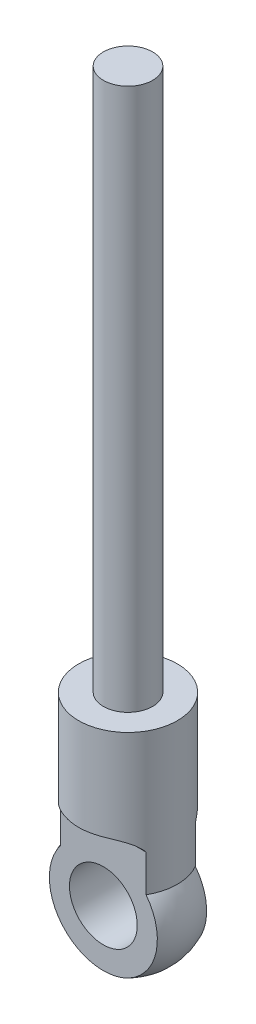
ISO-10303-21;
HEADER;
FILE_DESCRIPTION(('STEP AP214'),'2;1');
FILE_NAME('part.step','',(''),(''),'','','');
FILE_SCHEMA(('AUTOMOTIVE_DESIGN { 1 0 10303 214 1 1 1 1 }'));
ENDSEC;
DATA;
#1=APPLICATION_CONTEXT('core data for automotive mechanical design processes');
#2=APPLICATION_PROTOCOL_DEFINITION('international standard','automotive_design',2000,#1);
#3=PRODUCT_CONTEXT('',#1,'mechanical');
#4=PRODUCT('Part','Part','',(#3));
#5=PRODUCT_RELATED_PRODUCT_CATEGORY('part','',(#4));
#6=PRODUCT_DEFINITION_FORMATION('','',#4);
#7=PRODUCT_DEFINITION_CONTEXT('part definition',#1,'design');
#8=PRODUCT_DEFINITION('design','',#6,#7);
#9=PRODUCT_DEFINITION_SHAPE('','',#8);
#10=(LENGTH_UNIT() NAMED_UNIT(*) SI_UNIT(.MILLI.,.METRE.));
#11=(NAMED_UNIT(*) PLANE_ANGLE_UNIT() SI_UNIT($,.RADIAN.));
#12=(NAMED_UNIT(*) SI_UNIT($,.STERADIAN.) SOLID_ANGLE_UNIT());
#13=UNCERTAINTY_MEASURE_WITH_UNIT(LENGTH_MEASURE(1.E-05),#10,'distance_accuracy_value','');
#14=(GEOMETRIC_REPRESENTATION_CONTEXT(3) GLOBAL_UNCERTAINTY_ASSIGNED_CONTEXT((#13)) GLOBAL_UNIT_ASSIGNED_CONTEXT((#10,
#11,#12)) REPRESENTATION_CONTEXT('',''));
#15=CARTESIAN_POINT('',(0.,0.,0.));
#16=DIRECTION('',(0.,0.,1.));
#17=DIRECTION('',(1.,0.,0.));
#18=AXIS2_PLACEMENT_3D('',#15,#16,#17);
#19=CARTESIAN_POINT('',(0.,-14.1833333333333,0.));
#20=DIRECTION('',(0.,-1.,0.));
#21=DIRECTION('',(-1.,0.,0.));
#22=AXIS2_PLACEMENT_3D('',#19,#20,#21);
#23=SPHERICAL_SURFACE('',#22,4.81666666666666);
#24=CARTESIAN_POINT('',(0.,-14.1833333333333,2.));
#25=DIRECTION('',(0.,0.,-1.));
#26=DIRECTION('',(0.,1.,0.));
#27=AXIS2_PLACEMENT_3D('',#24,#25,#26);
#28=CIRCLE('',#27,4.38181215683395);
#29=CARTESIAN_POINT('',(3.46410161513775,-11.5,2.));
#30=VERTEX_POINT('',#29);
#31=CARTESIAN_POINT('',(-3.46410161513775,-11.5,2.));
#32=VERTEX_POINT('',#31);
#33=EDGE_CURVE('E167',#30,#32,#28,.T.);
#34=ORIENTED_EDGE('',*,*,#33,.T.);
#35=CARTESIAN_POINT('',(0.,-11.5,0.));
#36=DIRECTION('',(0.,-1.,0.));
#37=DIRECTION('',(0.,0.,-1.));
#38=AXIS2_PLACEMENT_3D('',#35,#36,#37);
#39=CIRCLE('',#38,4.);
#40=CARTESIAN_POINT('',(-3.46410161513775,-11.5,-2.));
#41=VERTEX_POINT('',#40);
#42=EDGE_CURVE('E170',#32,#41,#39,.T.);
#43=ORIENTED_EDGE('',*,*,#42,.T.);
#44=CARTESIAN_POINT('',(0.,-14.1833333333333,-2.));
#45=DIRECTION('',(0.,0.,-1.));
#46=DIRECTION('',(0.,1.,0.));
#47=AXIS2_PLACEMENT_3D('',#44,#45,#46);
#48=CIRCLE('',#47,4.38181215683394);
#49=CARTESIAN_POINT('',(3.46410161513775,-11.5,-2.));
#50=VERTEX_POINT('',#49);
#51=EDGE_CURVE('E74',#50,#41,#48,.T.);
#52=ORIENTED_EDGE('',*,*,#51,.F.);
#53=EDGE_CURVE('E111',#50,#30,#39,.T.);
#54=ORIENTED_EDGE('',*,*,#53,.T.);
#55=EDGE_LOOP('',(#34,#43,#52,#54));
#56=FACE_BOUND('',#55,.T.);
#57=ADVANCED_FACE('F51',(#56),#23,.T.);
#58=CARTESIAN_POINT('',(0.,0.,0.));
#59=DIRECTION('',(0.,-1.,0.));
#60=DIRECTION('',(0.,0.,-1.));
#61=AXIS2_PLACEMENT_3D('',#58,#59,#60);
#62=CYLINDRICAL_SURFACE('',#61,4.);
#63=CARTESIAN_POINT('',(0.,0.,0.));
#64=DIRECTION('',(0.,-1.,0.));
#65=DIRECTION('',(0.,0.,-1.));
#66=AXIS2_PLACEMENT_3D('',#63,#64,#65);
#67=CIRCLE('',#66,4.);
#68=CARTESIAN_POINT('',(0.,0.,-4.));
#69=VERTEX_POINT('',#68);
#70=EDGE_CURVE('E178',#69,#69,#67,.T.);
#71=ORIENTED_EDGE('',*,*,#70,.T.);
#72=EDGE_LOOP('',(#71));
#73=FACE_BOUND('',#72,.T.);
#74=CARTESIAN_POINT('',(-3.46410161513776,-11.5,2.));
#75=CARTESIAN_POINT('',(-3.48505742822508,-11.4516236882403,1.96369983455173));
#76=CARTESIAN_POINT('',(-3.50441881772126,-11.4014765354883,1.92885064757099));
#77=CARTESIAN_POINT('',(-3.54013083235496,-11.2980139730111,1.86249743017676));
#78=CARTESIAN_POINT('',(-3.55648210578561,-11.24469924877,1.83099268008719));
#79=CARTESIAN_POINT('',(-3.58633448416375,-11.135350375821,1.77180778083842));
#80=CARTESIAN_POINT('',(-3.59984056854879,-11.0793211928056,1.74412097963159));
#81=CARTESIAN_POINT('',(-3.62423191112977,-10.9648842390785,1.69285106159996));
#82=CARTESIAN_POINT('',(-3.63511712092051,-10.9064764244588,1.66926802057014));
#83=CARTESIAN_POINT('',(-3.66412623193404,-10.7283159282252,1.60512261604379));
#84=CARTESIAN_POINT('',(-3.67863206301334,-10.6055176660132,1.57110487936452));
#85=CARTESIAN_POINT('',(-3.69916546076441,-10.3555539891076,1.52213027146439));
#86=CARTESIAN_POINT('',(-3.70519167881027,-10.2283878830316,1.50717643226485));
#87=CARTESIAN_POINT('',(-3.70938882671181,-9.97149489366128,1.4968202471759));
#88=CARTESIAN_POINT('',(-3.7074591114322,-9.84175599169627,1.50166839566793));
#89=CARTESIAN_POINT('',(-3.69531469409487,-9.58494916267766,1.53130704014173));
#90=CARTESIAN_POINT('',(-3.6850986187928,-9.45788168192239,1.55610084158078));
#91=CARTESIAN_POINT('',(-3.65534567908771,-9.20948906496329,1.62476027814744));
#92=CARTESIAN_POINT('',(-3.63576592394964,-9.08819320561599,1.66871359140429));
#93=CARTESIAN_POINT('',(-3.58574617226035,-8.85564224980118,1.77363488888057));
#94=CARTESIAN_POINT('',(-3.55531023313985,-8.74438342149452,1.83459651449832));
#95=CARTESIAN_POINT('',(-3.4827089343538,-8.53733792578547,1.96886111269921));
#96=CARTESIAN_POINT('',(-3.44080057569296,-8.44127768824531,2.04188116966314));
#97=CARTESIAN_POINT('',(-3.34391896652423,-8.26425537994537,2.19693714971771));
#98=CARTESIAN_POINT('',(-3.28894821897836,-8.18329042198699,2.27897134393901));
#99=CARTESIAN_POINT('',(-3.16632115091152,-8.0382098196445,2.44643855016957));
#100=CARTESIAN_POINT('',(-3.09879023214102,-7.97394149450098,2.53183189592829));
#101=CARTESIAN_POINT('',(-2.95144285753561,-7.86082098328695,2.70216080214703));
#102=CARTESIAN_POINT('',(-2.87162310555112,-7.81197294404888,2.78709623343883));
#103=CARTESIAN_POINT('',(-2.69394312081619,-7.7245411426854,2.95960470212821));
#104=CARTESIAN_POINT('',(-2.59513069086336,-7.68716427149863,3.04679998150616));
#105=CARTESIAN_POINT('',(-2.38677154824466,-7.62556915710695,3.21264489259502));
#106=CARTESIAN_POINT('',(-2.27721493269961,-7.60136319059798,3.29128649693268));
#107=CARTESIAN_POINT('',(-2.07816266343584,-7.56772089288594,3.41928891400126));
#108=CARTESIAN_POINT('',(-1.99053951122883,-7.55610196248371,3.47104306220469));
#109=CARTESIAN_POINT('',(-1.81120713696376,-7.53713026494153,3.56790021216443));
#110=CARTESIAN_POINT('',(-1.71949635468132,-7.52977914207691,3.6130006454325));
#111=CARTESIAN_POINT('',(-1.53261960366885,-7.51817757074083,3.69615401308953));
#112=CARTESIAN_POINT('',(-1.43744940917219,-7.51393105804441,3.73419795641385));
#113=CARTESIAN_POINT('',(-1.24442093301576,-7.50754457612174,3.80288181414419));
#114=CARTESIAN_POINT('',(-1.14656290718302,-7.50540440712357,3.83352243049585));
#115=CARTESIAN_POINT('',(-0.947470687492997,-7.50238146239822,3.88755425095047));
#116=CARTESIAN_POINT('',(-0.846209055864686,-7.50151553127478,3.91084519593677));
#117=CARTESIAN_POINT('',(-0.64217764356532,-7.50043576725357,3.94947954499916));
#118=CARTESIAN_POINT('',(-0.539407843874386,-7.50022194258678,3.96482284875685));
#119=CARTESIAN_POINT('',(-0.333023763641647,-7.5000057179673,3.98746380930005));
#120=CARTESIAN_POINT('',(-0.229409810295539,-7.5000032396633,3.99476444670941));
#121=CARTESIAN_POINT('',(-0.0219267732101429,-7.4999983198757,4.00128644869187));
#122=CARTESIAN_POINT('',(0.0819423180896407,-7.49999587839321,4.00050757088553));
#123=CARTESIAN_POINT('',(0.29777691989608,-7.50001219007271,3.99048015565368));
#124=CARTESIAN_POINT('',(0.409711172077717,-7.50003268972412,3.98054539057031));
#125=CARTESIAN_POINT('',(0.632357887244195,-7.50043190502387,3.9512950059505));
#126=CARTESIAN_POINT('',(0.743070211956088,-7.50081066080032,3.93197833566896));
#127=CARTESIAN_POINT('',(0.962520204687622,-7.50257348287296,3.88409237366952));
#128=CARTESIAN_POINT('',(1.07125697425405,-7.5039579953943,3.85551897812918));
#129=CARTESIAN_POINT('',(1.28589412816036,-7.50867060713599,3.78933803047751));
#130=CARTESIAN_POINT('',(1.39179500420719,-7.51199836711052,3.75173205591885));
#131=CARTESIAN_POINT('',(1.5831570578028,-7.52101862140842,3.67457159963226));
#132=CARTESIAN_POINT('',(1.66916223985222,-7.52624369973875,3.6363073915507));
#133=CARTESIAN_POINT('',(1.83806542085,-7.5397653655292,3.55391890095554));
#134=CARTESIAN_POINT('',(1.92096394222509,-7.54806143398549,3.50979560944699));
#135=CARTESIAN_POINT('',(2.08297268266984,-7.568663912715,3.41613331905007));
#136=CARTESIAN_POINT('',(2.16208822830934,-7.58096448165086,3.36660227793519));
#137=CARTESIAN_POINT('',(2.31602285264499,-7.61061014043094,3.26261495721181));
#138=CARTESIAN_POINT('',(2.39084303844722,-7.62795392336031,3.2081599561302));
#139=CARTESIAN_POINT('',(2.51930646044854,-7.66417414726008,3.10776053039405));
#140=CARTESIAN_POINT('',(2.57393945087159,-7.68183725366142,3.06264169085348));
#141=CARTESIAN_POINT('',(2.67988593564515,-7.72131753156808,2.97037735516947));
#142=CARTESIAN_POINT('',(2.73120020849824,-7.74313372407532,2.92323233867615));
#143=CARTESIAN_POINT('',(2.83019101144801,-7.79135431775187,2.82750045801087));
#144=CARTESIAN_POINT('',(2.8778682426104,-7.81775783145003,2.77891387423191));
#145=CARTESIAN_POINT('',(2.96928366611156,-7.87549924530486,2.68101419839438));
#146=CARTESIAN_POINT('',(3.01302383150834,-7.90683465195998,2.63170148481648));
#147=CARTESIAN_POINT('',(3.09669701306069,-7.97497049462831,2.53272602248669));
#148=CARTESIAN_POINT('',(3.13659605473353,-8.01181343406049,2.48306370052988));
#149=CARTESIAN_POINT('',(3.2120022640101,-8.09085299285066,2.38471807238895));
#150=CARTESIAN_POINT('',(3.24751147949259,-8.1330470971067,2.33603431864129));
#151=CARTESIAN_POINT('',(3.31410727401972,-8.22274496647899,2.24055385745405));
#152=CARTESIAN_POINT('',(3.34519379041616,-8.27024880679143,2.19375717675185));
#153=CARTESIAN_POINT('',(3.40299180099458,-8.37030485858221,2.10298475464623));
#154=CARTESIAN_POINT('',(3.42970377441903,-8.42285651605705,2.05900870455697));
#155=CARTESIAN_POINT('',(3.49748039066586,-8.57412251046848,1.94292461255456));
#156=CARTESIAN_POINT('',(3.53419505154906,-8.67778527746387,1.87458509494025));
#157=CARTESIAN_POINT('',(3.59601020259842,-8.89673508930151,1.75311018664678));
#158=CARTESIAN_POINT('',(3.6211106842399,-9.01202214267577,1.69997480712728));
#159=CARTESIAN_POINT('',(3.66092996906082,-9.24836326617673,1.61240873426991));
#160=CARTESIAN_POINT('',(3.67585393627529,-9.36924740885467,1.57761182251698));
#161=CARTESIAN_POINT('',(3.69736051740217,-9.61557185362247,1.52653196321747));
#162=CARTESIAN_POINT('',(3.70394286967647,-9.74101229849565,1.51024959638873));
#163=CARTESIAN_POINT('',(3.70945509492467,-9.99611909135715,1.49666425836184));
#164=CARTESIAN_POINT('',(3.70819704883148,-10.1258145014297,1.49982733221703));
#165=CARTESIAN_POINT('',(3.69745356488751,-10.3828799481525,1.52611698300973));
#166=CARTESIAN_POINT('',(3.68796489432344,-10.5102490510347,1.54925140400566));
#167=CARTESIAN_POINT('',(3.659771953275,-10.7597516698588,1.61472761576265));
#168=CARTESIAN_POINT('',(3.64100965483043,-10.8818468857131,1.6571902148699));
#169=CARTESIAN_POINT('',(3.592741099643,-11.1161608643074,1.75936509106798));
#170=CARTESIAN_POINT('',(3.56325570666003,-11.2283982842667,1.8190438246826));
#171=CARTESIAN_POINT('',(3.51798148232311,-11.3626654131736,1.90373973145959));
#172=CARTESIAN_POINT('',(3.50785467605053,-11.3908664315831,1.92235042726624));
#173=CARTESIAN_POINT('',(3.48667938494603,-11.4462171408237,1.96049560162438));
#174=CARTESIAN_POINT('',(3.47563219526777,-11.4733682328313,1.98002876585539));
#175=CARTESIAN_POINT('',(3.46410161513776,-11.5,2.));
#176=B_SPLINE_CURVE_WITH_KNOTS('',3,(#74,#75,#76,#77,#78,#79,#80,#81,#82,#83,#84,#85,#86,#87,
#88,#89,#90,#91,#92,#93,#94,#95,#96,#97,#98,#99,#100,#101,#102,#103,#104,#105,#106,#107,#108,
#109,#110,#111,#112,#113,#114,#115,#116,#117,#118,#119,#120,#121,#122,#123,#124,#125,#126,#127,
#128,#129,#130,#131,#132,#133,#134,#135,#136,#137,#138,#139,#140,#141,#142,#143,#144,#145,#146,
#147,#148,#149,#150,#151,#152,#153,#154,#155,#156,#157,#158,#159,#160,#161,#162,#163,#164,#165,
#166,#167,#168,#169,#170,#171,#172,#173,#174,#175),.UNSPECIFIED.,.F.,.F.,(4,2,2,2,2,2,2,2,2,2,2,
2,2,2,2,2,2,2,2,2,2,2,2,2,2,2,2,2,2,2,2,2,2,2,2,2,2,2,2,2,2,2,2,2,2,2,2,2,2,2,4),(0.,
0.191956150665621,0.383870910960549,0.575446953519253,0.767026534043728,1.14981009539002,
1.53265452903099,1.92035683255558,2.30812340058271,2.69768341477958,3.08709798565704,
3.46841689115728,3.84966278871073,4.22728885793394,4.60501639224434,5.01447344631598,
5.42431150731335,5.73121424297416,6.03823514194969,6.34564458560031,6.65302487081047,
6.96443311960283,7.27584529902211,7.58714202976914,7.89844809921356,8.2351675519216,
8.57192472489245,8.90883139859596,9.24567927380462,9.52825201467944,9.81077702195,
10.0928917447584,10.3749334244967,10.5938045136342,10.8126240725046,11.031401345205,
11.2500683601638,11.470519489006,11.6908673849298,11.9112184018038,12.1315452624832,
12.5178770836597,12.9042091883986,13.2825020852019,13.6608068470212,14.0482131466708,
14.4357716754576,14.8257865779018,15.2150466590723,15.3208410617573,15.4264890279366),.UNSPECIFIED.);
#177=CARTESIAN_POINT('',(-3.46410161513776,-8.5,2.));
#178=VERTEX_POINT('',#177);
#179=CARTESIAN_POINT('',(3.46410161513776,-8.5,2.));
#180=VERTEX_POINT('',#179);
#181=EDGE_CURVE('E113',#178,#180,#176,.T.);
#182=ORIENTED_EDGE('',*,*,#181,.T.);
#183=DIRECTION('',(0.,-1.,0.));
#184=VECTOR('',#183,1.);
#185=CARTESIAN_POINT('',(3.46410161513775,0.,2.));
#186=LINE('',#185,#184);
#187=EDGE_CURVE('E11',#180,#30,#186,.T.);
#188=ORIENTED_EDGE('',*,*,#187,.T.);
#189=ORIENTED_EDGE('',*,*,#53,.F.);
#190=DIRECTION('',(0.,-1.,0.));
#191=VECTOR('',#190,1.);
#192=CARTESIAN_POINT('',(3.46410161513775,0.,-2.));
#193=LINE('',#192,#191);
#194=CARTESIAN_POINT('',(3.46410161513775,-8.49999999999999,-2.));
#195=VERTEX_POINT('',#194);
#196=EDGE_CURVE('E100',#195,#50,#193,.T.);
#197=ORIENTED_EDGE('',*,*,#196,.F.);
#198=CARTESIAN_POINT('',(-3.46410161513775,-11.5,-2.));
#199=CARTESIAN_POINT('',(-3.48505742822508,-11.4516236882403,-1.96369983455173));
#200=CARTESIAN_POINT('',(-3.50441881772126,-11.4014765354883,-1.92885064757099));
#201=CARTESIAN_POINT('',(-3.54013083235496,-11.2980139730111,-1.86249743017676));
#202=CARTESIAN_POINT('',(-3.55648210578561,-11.24469924877,-1.83099268008719));
#203=CARTESIAN_POINT('',(-3.58633448416375,-11.135350375821,-1.77180778083843));
#204=CARTESIAN_POINT('',(-3.59984056854879,-11.0793211928056,-1.74412097963159));
#205=CARTESIAN_POINT('',(-3.62423191112977,-10.9648842390785,-1.69285106159996));
#206=CARTESIAN_POINT('',(-3.63511712092051,-10.9064764244588,-1.66926802057014));
#207=CARTESIAN_POINT('',(-3.66412623193404,-10.7283159282252,-1.60512261604379));
#208=CARTESIAN_POINT('',(-3.67863206301334,-10.6055176660132,-1.57110487936452));
#209=CARTESIAN_POINT('',(-3.69916546076441,-10.3555539891076,-1.52213027146439));
#210=CARTESIAN_POINT('',(-3.70519167881027,-10.2283878830316,-1.50717643226485));
#211=CARTESIAN_POINT('',(-3.70938882671181,-9.97149489366128,-1.4968202471759));
#212=CARTESIAN_POINT('',(-3.7074591114322,-9.84175599169627,-1.50166839566793));
#213=CARTESIAN_POINT('',(-3.69531469409487,-9.58494916267766,-1.53130704014173));
#214=CARTESIAN_POINT('',(-3.6850986187928,-9.45788168192239,-1.55610084158078));
#215=CARTESIAN_POINT('',(-3.65534567908771,-9.20948906496329,-1.62476027814744));
#216=CARTESIAN_POINT('',(-3.63576592394964,-9.08819320561599,-1.66871359140429));
#217=CARTESIAN_POINT('',(-3.58574617226035,-8.85564224980118,-1.77363488888057));
#218=CARTESIAN_POINT('',(-3.55531023313985,-8.74438342149452,-1.83459651449832));
#219=CARTESIAN_POINT('',(-3.4827089343538,-8.53733792578547,-1.96886111269921));
#220=CARTESIAN_POINT('',(-3.44080057569296,-8.44127768824531,-2.04188116966314));
#221=CARTESIAN_POINT('',(-3.34391896652423,-8.26425537994537,-2.19693714971771));
#222=CARTESIAN_POINT('',(-3.28894821897836,-8.18329042198699,-2.27897134393901));
#223=CARTESIAN_POINT('',(-3.16632115091152,-8.0382098196445,-2.44643855016957));
#224=CARTESIAN_POINT('',(-3.09879023214102,-7.97394149450098,-2.53183189592829));
#225=CARTESIAN_POINT('',(-2.95144285753561,-7.86082098328695,-2.70216080214703));
#226=CARTESIAN_POINT('',(-2.87162310555112,-7.81197294404888,-2.78709623343883));
#227=CARTESIAN_POINT('',(-2.69394312081619,-7.72454114268539,-2.95960470212821));
#228=CARTESIAN_POINT('',(-2.59513069086336,-7.68716427149862,-3.04679998150616));
#229=CARTESIAN_POINT('',(-2.38677154824466,-7.62556915710695,-3.21264489259502));
#230=CARTESIAN_POINT('',(-2.27721493269961,-7.60136319059797,-3.29128649693268));
#231=CARTESIAN_POINT('',(-2.07816266343583,-7.56772089288594,-3.41928891400126));
#232=CARTESIAN_POINT('',(-1.99053951122883,-7.55610196248371,-3.47104306220469));
#233=CARTESIAN_POINT('',(-1.81120713696376,-7.53713026494153,-3.56790021216443));
#234=CARTESIAN_POINT('',(-1.71949635468132,-7.5297791420769,-3.6130006454325));
#235=CARTESIAN_POINT('',(-1.53261960366885,-7.51817757074083,-3.69615401308952));
#236=CARTESIAN_POINT('',(-1.43744940917219,-7.5139310580444,-3.73419795641385));
#237=CARTESIAN_POINT('',(-1.24442093301576,-7.50754457612174,-3.80288181414419));
#238=CARTESIAN_POINT('',(-1.14656290718302,-7.50540440712357,-3.83352243049585));
#239=CARTESIAN_POINT('',(-0.947470687492997,-7.50238146239822,-3.88755425095047));
#240=CARTESIAN_POINT('',(-0.846209055864686,-7.50151553127478,-3.91084519593677));
#241=CARTESIAN_POINT('',(-0.64217764356532,-7.50043576725357,-3.94947954499916));
#242=CARTESIAN_POINT('',(-0.539407843874386,-7.50022194258678,-3.96482284875685));
#243=CARTESIAN_POINT('',(-0.333023763641646,-7.50000571796729,-3.98746380930005));
#244=CARTESIAN_POINT('',(-0.229409810295539,-7.5000032396633,-3.99476444670941));
#245=CARTESIAN_POINT('',(-0.0219267732101429,-7.4999983198757,-4.00128644869187));
#246=CARTESIAN_POINT('',(0.0819423180896408,-7.49999587839321,-4.00050757088553));
#247=CARTESIAN_POINT('',(0.29777691989608,-7.5000121900727,-3.99048015565368));
#248=CARTESIAN_POINT('',(0.409711172077717,-7.50003268972412,-3.98054539057031));
#249=CARTESIAN_POINT('',(0.632357887244195,-7.50043190502386,-3.9512950059505));
#250=CARTESIAN_POINT('',(0.743070211956088,-7.50081066080031,-3.93197833566896));
#251=CARTESIAN_POINT('',(0.962520204687623,-7.50257348287295,-3.88409237366952));
#252=CARTESIAN_POINT('',(1.07125697425405,-7.5039579953943,-3.85551897812918));
#253=CARTESIAN_POINT('',(1.28589412816036,-7.50867060713599,-3.78933803047751));
#254=CARTESIAN_POINT('',(1.39179500420719,-7.51199836711052,-3.75173205591885));
#255=CARTESIAN_POINT('',(1.5831570578028,-7.52101862140842,-3.67457159963226));
#256=CARTESIAN_POINT('',(1.66916223985222,-7.52624369973875,-3.6363073915507));
#257=CARTESIAN_POINT('',(1.83806542085,-7.5397653655292,-3.55391890095554));
#258=CARTESIAN_POINT('',(1.92096394222509,-7.54806143398549,-3.50979560944699));
#259=CARTESIAN_POINT('',(2.08297268266984,-7.568663912715,-3.41613331905007));
#260=CARTESIAN_POINT('',(2.16208822830934,-7.58096448165086,-3.3666022779352));
#261=CARTESIAN_POINT('',(2.316022852645,-7.61061014043094,-3.26261495721181));
#262=CARTESIAN_POINT('',(2.39084303844722,-7.6279539233603,-3.2081599561302));
#263=CARTESIAN_POINT('',(2.51930646044854,-7.66417414726007,-3.10776053039405));
#264=CARTESIAN_POINT('',(2.57393945087159,-7.68183725366142,-3.06264169085348));
#265=CARTESIAN_POINT('',(2.67988593564515,-7.72131753156808,-2.97037735516947));
#266=CARTESIAN_POINT('',(2.73120020849824,-7.74313372407532,-2.92323233867615));
#267=CARTESIAN_POINT('',(2.83019101144801,-7.79135431775187,-2.82750045801087));
#268=CARTESIAN_POINT('',(2.8778682426104,-7.81775783145003,-2.77891387423191));
#269=CARTESIAN_POINT('',(2.96928366611156,-7.87549924530486,-2.68101419839438));
#270=CARTESIAN_POINT('',(3.01302383150834,-7.90683465195998,-2.63170148481648));
#271=CARTESIAN_POINT('',(3.09669701306069,-7.97497049462831,-2.53272602248669));
#272=CARTESIAN_POINT('',(3.13659605473353,-8.01181343406049,-2.48306370052988));
#273=CARTESIAN_POINT('',(3.2120022640101,-8.09085299285066,-2.38471807238895));
#274=CARTESIAN_POINT('',(3.24751147949259,-8.1330470971067,-2.33603431864129));
#275=CARTESIAN_POINT('',(3.31410727401972,-8.22274496647899,-2.24055385745405));
#276=CARTESIAN_POINT('',(3.34519379041616,-8.27024880679143,-2.19375717675185));
#277=CARTESIAN_POINT('',(3.40299180099458,-8.37030485858221,-2.10298475464623));
#278=CARTESIAN_POINT('',(3.42970377441903,-8.42285651605705,-2.05900870455697));
#279=CARTESIAN_POINT('',(3.49748039066586,-8.57412251046848,-1.94292461255456));
#280=CARTESIAN_POINT('',(3.53419505154906,-8.67778527746387,-1.87458509494025));
#281=CARTESIAN_POINT('',(3.59601020259842,-8.89673508930151,-1.75311018664678));
#282=CARTESIAN_POINT('',(3.6211106842399,-9.01202214267576,-1.69997480712728));
#283=CARTESIAN_POINT('',(3.66092996906082,-9.24836326617673,-1.61240873426991));
#284=CARTESIAN_POINT('',(3.67585393627528,-9.36924740885467,-1.57761182251698));
#285=CARTESIAN_POINT('',(3.69736051740217,-9.61557185362247,-1.52653196321747));
#286=CARTESIAN_POINT('',(3.70394286967647,-9.74101229849565,-1.51024959638873));
#287=CARTESIAN_POINT('',(3.70945509492467,-9.99611909135715,-1.49666425836184));
#288=CARTESIAN_POINT('',(3.70819704883148,-10.1258145014297,-1.49982733221703));
#289=CARTESIAN_POINT('',(3.69745356488751,-10.3828799481525,-1.52611698300973));
#290=CARTESIAN_POINT('',(3.68796489432344,-10.5102490510347,-1.54925140400566));
#291=CARTESIAN_POINT('',(3.65977195327499,-10.7597516698588,-1.61472761576266));
#292=CARTESIAN_POINT('',(3.64100965483043,-10.8818468857131,-1.6571902148699));
#293=CARTESIAN_POINT('',(3.592741099643,-11.1161608643074,-1.75936509106798));
#294=CARTESIAN_POINT('',(3.56325570666003,-11.2283982842667,-1.8190438246826));
#295=CARTESIAN_POINT('',(3.51798148232311,-11.3626654131736,-1.9037397314596));
#296=CARTESIAN_POINT('',(3.50785467605053,-11.3908664315831,-1.92235042726624));
#297=CARTESIAN_POINT('',(3.48667938494603,-11.4462171408237,-1.96049560162438));
#298=CARTESIAN_POINT('',(3.47563219526776,-11.4733682328313,-1.98002876585539));
#299=CARTESIAN_POINT('',(3.46410161513775,-11.5,-2.));
#300=B_SPLINE_CURVE_WITH_KNOTS('',3,(#198,#199,#200,#201,#202,#203,#204,#205,#206,#207,#208,
#209,#210,#211,#212,#213,#214,#215,#216,#217,#218,#219,#220,#221,#222,#223,#224,#225,#226,#227,
#228,#229,#230,#231,#232,#233,#234,#235,#236,#237,#238,#239,#240,#241,#242,#243,#244,#245,#246,
#247,#248,#249,#250,#251,#252,#253,#254,#255,#256,#257,#258,#259,#260,#261,#262,#263,#264,#265,
#266,#267,#268,#269,#270,#271,#272,#273,#274,#275,#276,#277,#278,#279,#280,#281,#282,#283,#284,
#285,#286,#287,#288,#289,#290,#291,#292,#293,#294,#295,#296,#297,#298,#299),.UNSPECIFIED.,.F.,
.F.,(4,2,2,2,2,2,2,2,2,2,2,2,2,2,2,2,2,2,2,2,2,2,2,2,2,2,2,2,2,2,2,2,2,2,2,2,2,2,2,2,2,2,2,2,2,
2,2,2,2,2,4),(0.,0.191956150665621,0.383870910960549,0.575446953519252,0.767026534043728,
1.14981009539002,1.53265452903099,1.92035683255558,2.30812340058271,2.69768341477958,
3.08709798565704,3.46841689115728,3.84966278871073,4.22728885793394,4.60501639224434,
5.01447344631598,5.42431150731336,5.73121424297416,6.03823514194969,6.34564458560031,
6.65302487081047,6.96443311960283,7.27584529902211,7.58714202976914,7.89844809921356,
8.2351675519216,8.57192472489245,8.90883139859596,9.24567927380462,9.52825201467944,
9.81077702195,10.0928917447584,10.3749334244967,10.5938045136342,10.8126240725046,
11.031401345205,11.2500683601638,11.470519489006,11.6908673849298,11.9112184018038,
12.1315452624832,12.5178770836597,12.9042091883986,13.2825020852019,13.6608068470212,
14.0482131466708,14.4357716754576,14.8257865779018,15.2150466590723,15.3208410617573,
15.4264890279366),.UNSPECIFIED.);
#301=CARTESIAN_POINT('',(-3.46410161513775,-8.49999999999999,-2.));
#302=VERTEX_POINT('',#301);
#303=EDGE_CURVE('E93',#302,#195,#300,.T.);
#304=ORIENTED_EDGE('',*,*,#303,.F.);
#305=DIRECTION('',(0.,-1.,0.));
#306=VECTOR('',#305,1.);
#307=CARTESIAN_POINT('',(-3.46410161513775,0.,-2.));
#308=LINE('',#307,#306);
#309=EDGE_CURVE('E101',#41,#302,#308,.F.);
#310=ORIENTED_EDGE('',*,*,#309,.F.);
#311=ORIENTED_EDGE('',*,*,#42,.F.);
#312=DIRECTION('',(0.,-1.,0.));
#313=VECTOR('',#312,1.);
#314=CARTESIAN_POINT('',(-3.46410161513775,0.,2.));
#315=LINE('',#314,#313);
#316=EDGE_CURVE('E60',#32,#178,#315,.F.);
#317=ORIENTED_EDGE('',*,*,#316,.T.);
#318=EDGE_LOOP('',(#182,#188,#189,#197,#304,#310,#311,#317));
#319=FACE_BOUND('',#318,.T.);
#320=ADVANCED_FACE('F109',(#73,#319),#62,.T.);
#321=CARTESIAN_POINT('',(-2.,0.,0.));
#322=DIRECTION('',(0.,-1.,0.));
#323=DIRECTION('',(0.,0.,-1.));
#324=AXIS2_PLACEMENT_3D('',#321,#322,#323);
#325=PLANE('',#324);
#326=ORIENTED_EDGE('',*,*,#70,.F.);
#327=EDGE_LOOP('',(#326));
#328=FACE_BOUND('',#327,.T.);
#329=CARTESIAN_POINT('',(0.,0.,0.));
#330=DIRECTION('',(0.,-1.,0.));
#331=DIRECTION('',(0.,0.,-1.));
#332=AXIS2_PLACEMENT_3D('',#329,#330,#331);
#333=CIRCLE('',#332,2.);
#334=CARTESIAN_POINT('',(0.,0.,-2.));
#335=VERTEX_POINT('',#334);
#336=EDGE_CURVE('E183',#335,#335,#333,.T.);
#337=ORIENTED_EDGE('',*,*,#336,.T.);
#338=EDGE_LOOP('',(#337));
#339=FACE_BOUND('',#338,.T.);
#340=ADVANCED_FACE('F152',(#328,#339),#325,.F.);
#341=CARTESIAN_POINT('',(0.,0.,0.));
#342=DIRECTION('',(0.,-1.,0.));
#343=DIRECTION('',(0.,0.,-1.));
#344=AXIS2_PLACEMENT_3D('',#341,#342,#343);
#345=CYLINDRICAL_SURFACE('',#344,2.);
#346=ORIENTED_EDGE('',*,*,#336,.F.);
#347=EDGE_LOOP('',(#346));
#348=FACE_BOUND('',#347,.T.);
#349=CARTESIAN_POINT('',(0.,44.,0.));
#350=DIRECTION('',(0.,-1.,0.));
#351=DIRECTION('',(0.,0.,-1.));
#352=AXIS2_PLACEMENT_3D('',#349,#350,#351);
#353=CIRCLE('',#352,2.);
#354=CARTESIAN_POINT('',(0.,44.,-2.));
#355=VERTEX_POINT('',#354);
#356=EDGE_CURVE('E173',#355,#355,#353,.T.);
#357=ORIENTED_EDGE('',*,*,#356,.T.);
#358=EDGE_LOOP('',(#357));
#359=FACE_BOUND('',#358,.T.);
#360=ADVANCED_FACE('F149',(#348,#359),#345,.T.);
#361=CARTESIAN_POINT('',(0.,44.,0.));
#362=DIRECTION('',(0.,-1.,0.));
#363=DIRECTION('',(0.,0.,-1.));
#364=AXIS2_PLACEMENT_3D('',#361,#362,#363);
#365=PLANE('',#364);
#366=ORIENTED_EDGE('',*,*,#356,.F.);
#367=EDGE_LOOP('',(#366));
#368=FACE_BOUND('',#367,.T.);
#369=ADVANCED_FACE('F146',(#368),#365,.F.);
#370=CARTESIAN_POINT('',(4.81666666666666,-10.,-4.));
#371=DIRECTION('',(-1.,0.,0.));
#372=DIRECTION('',(0.,0.,1.));
#373=AXIS2_PLACEMENT_3D('',#370,#371,#372);
#374=CYLINDRICAL_SURFACE('',#373,2.5);
#375=ORIENTED_EDGE('',*,*,#303,.T.);
#376=DIRECTION('',(-1.,0.,0.));
#377=VECTOR('',#376,1.);
#378=CARTESIAN_POINT('',(4.81666666666666,-8.49999999999999,-2.));
#379=LINE('',#378,#377);
#380=EDGE_CURVE('E96',#195,#302,#379,.T.);
#381=ORIENTED_EDGE('',*,*,#380,.T.);
#382=EDGE_LOOP('',(#375,#381));
#383=FACE_BOUND('',#382,.T.);
#384=ADVANCED_FACE('F95',(#383),#374,.F.);
#385=CARTESIAN_POINT('',(4.81666666666666,0.,-2.));
#386=DIRECTION('',(0.,0.,-1.));
#387=DIRECTION('',(0.,1.,0.));
#388=AXIS2_PLACEMENT_3D('',#385,#386,#387);
#389=PLANE('',#388);
#390=CARTESIAN_POINT('',(0.,-14.,-2.));
#391=DIRECTION('',(0.,0.,-1.));
#392=DIRECTION('',(0.,1.,0.));
#393=AXIS2_PLACEMENT_3D('',#390,#391,#392);
#394=CIRCLE('',#393,2.75);
#395=CARTESIAN_POINT('',(0.,-11.25,-2.));
#396=VERTEX_POINT('',#395);
#397=EDGE_CURVE('E105',#396,#396,#394,.T.);
#398=ORIENTED_EDGE('',*,*,#397,.F.);
#399=EDGE_LOOP('',(#398));
#400=FACE_BOUND('',#399,.T.);
#401=ORIENTED_EDGE('',*,*,#196,.T.);
#402=ORIENTED_EDGE('',*,*,#51,.T.);
#403=ORIENTED_EDGE('',*,*,#309,.T.);
#404=ORIENTED_EDGE('',*,*,#380,.F.);
#405=EDGE_LOOP('',(#401,#402,#403,#404));
#406=FACE_BOUND('',#405,.T.);
#407=ADVANCED_FACE('F103',(#400,#406),#389,.T.);
#408=CARTESIAN_POINT('',(4.81666666666666,0.,2.));
#409=DIRECTION('',(0.,0.,-1.));
#410=DIRECTION('',(0.,1.,0.));
#411=AXIS2_PLACEMENT_3D('',#408,#409,#410);
#412=PLANE('',#411);
#413=CARTESIAN_POINT('',(0.,-14.,2.));
#414=DIRECTION('',(0.,0.,-1.));
#415=DIRECTION('',(0.,1.,0.));
#416=AXIS2_PLACEMENT_3D('',#413,#414,#415);
#417=CIRCLE('',#416,2.75);
#418=CARTESIAN_POINT('',(0.,-11.25,2.));
#419=VERTEX_POINT('',#418);
#420=EDGE_CURVE('E54',#419,#419,#417,.T.);
#421=ORIENTED_EDGE('',*,*,#420,.T.);
#422=EDGE_LOOP('',(#421));
#423=FACE_BOUND('',#422,.T.);
#424=DIRECTION('',(-1.,0.,0.));
#425=VECTOR('',#424,1.);
#426=CARTESIAN_POINT('',(4.81666666666666,-8.5,2.));
#427=LINE('',#426,#425);
#428=EDGE_CURVE('E66',#180,#178,#427,.T.);
#429=ORIENTED_EDGE('',*,*,#428,.T.);
#430=ORIENTED_EDGE('',*,*,#316,.F.);
#431=ORIENTED_EDGE('',*,*,#33,.F.);
#432=ORIENTED_EDGE('',*,*,#187,.F.);
#433=EDGE_LOOP('',(#429,#430,#431,#432));
#434=FACE_BOUND('',#433,.T.);
#435=ADVANCED_FACE('F137',(#423,#434),#412,.F.);
#436=CARTESIAN_POINT('',(4.81666666666666,-10.,4.));
#437=DIRECTION('',(-1.,0.,0.));
#438=DIRECTION('',(0.,0.,1.));
#439=AXIS2_PLACEMENT_3D('',#436,#437,#438);
#440=CYLINDRICAL_SURFACE('',#439,2.5);
#441=ORIENTED_EDGE('',*,*,#428,.F.);
#442=ORIENTED_EDGE('',*,*,#181,.F.);
#443=EDGE_LOOP('',(#441,#442));
#444=FACE_BOUND('',#443,.T.);
#445=ADVANCED_FACE('F131',(#444),#440,.F.);
#446=CARTESIAN_POINT('',(0.,-14.,-4.));
#447=DIRECTION('',(0.,0.,1.));
#448=DIRECTION('',(1.,0.,0.));
#449=AXIS2_PLACEMENT_3D('',#446,#447,#448);
#450=CYLINDRICAL_SURFACE('',#449,2.75);
#451=ORIENTED_EDGE('',*,*,#397,.T.);
#452=EDGE_LOOP('',(#451));
#453=FACE_BOUND('',#452,.T.);
#454=ORIENTED_EDGE('',*,*,#420,.F.);
#455=EDGE_LOOP('',(#454));
#456=FACE_BOUND('',#455,.T.);
#457=ADVANCED_FACE('F136',(#453,#456),#450,.F.);
#458=CLOSED_SHELL('',(#57,#320,#340,#360,#369,#384,#407,#435,#445,#457));
#459=MANIFOLD_SOLID_BREP('B2',#458);
#460=ADVANCED_BREP_SHAPE_REPRESENTATION('',(#18,#459),#14);
#461=SHAPE_DEFINITION_REPRESENTATION(#9,#460);
ENDSEC;
END-ISO-10303-21;
